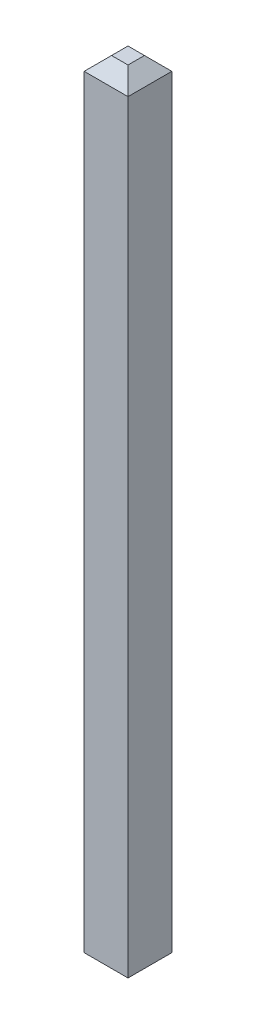
ISO-10303-21;
HEADER;
FILE_DESCRIPTION(('STEP AP214'),'2;1');
FILE_NAME('part.step','',(''),(''),'','','');
FILE_SCHEMA(('AUTOMOTIVE_DESIGN { 1 0 10303 214 1 1 1 1 }'));
ENDSEC;
DATA;
#1=APPLICATION_CONTEXT('core data for automotive mechanical design processes');
#2=APPLICATION_PROTOCOL_DEFINITION('international standard','automotive_design',2000,#1);
#3=PRODUCT_CONTEXT('',#1,'mechanical');
#4=PRODUCT('Part','Part','',(#3));
#5=PRODUCT_RELATED_PRODUCT_CATEGORY('part','',(#4));
#6=PRODUCT_DEFINITION_FORMATION('','',#4);
#7=PRODUCT_DEFINITION_CONTEXT('part definition',#1,'design');
#8=PRODUCT_DEFINITION('design','',#6,#7);
#9=PRODUCT_DEFINITION_SHAPE('','',#8);
#10=(LENGTH_UNIT() NAMED_UNIT(*) SI_UNIT(.MILLI.,.METRE.));
#11=(NAMED_UNIT(*) PLANE_ANGLE_UNIT() SI_UNIT($,.RADIAN.));
#12=(NAMED_UNIT(*) SI_UNIT($,.STERADIAN.) SOLID_ANGLE_UNIT());
#13=UNCERTAINTY_MEASURE_WITH_UNIT(LENGTH_MEASURE(1.E-05),#10,'distance_accuracy_value','');
#14=(GEOMETRIC_REPRESENTATION_CONTEXT(3) GLOBAL_UNCERTAINTY_ASSIGNED_CONTEXT((#13)) GLOBAL_UNIT_ASSIGNED_CONTEXT((#10,
#11,#12)) REPRESENTATION_CONTEXT('',''));
#15=CARTESIAN_POINT('',(0.,0.,0.));
#16=DIRECTION('',(0.,0.,1.));
#17=DIRECTION('',(1.,0.,0.));
#18=AXIS2_PLACEMENT_3D('',#15,#16,#17);
#19=CARTESIAN_POINT('',(3.93,-4.27,-0.32));
#20=DIRECTION('',(-0.707106781186548,0.707106781186548,0.));
#21=DIRECTION('',(-0.707106781186548,-0.707106781186548,0.));
#22=AXIS2_PLACEMENT_3D('',#19,#20,#21);
#23=PLANE('',#22);
#24=DIRECTION('',(0.,0.,1.));
#25=VECTOR('',#24,1.);
#26=CARTESIAN_POINT('',(4.13000000000001,-4.07,-0.32));
#27=LINE('',#26,#25);
#28=CARTESIAN_POINT('',(4.13,-4.07,-0.32));
#29=VERTEX_POINT('',#28);
#30=CARTESIAN_POINT('',(4.13,-4.07,0.32));
#31=VERTEX_POINT('',#30);
#32=EDGE_CURVE('E119',#29,#31,#27,.T.);
#33=ORIENTED_EDGE('',*,*,#32,.T.);
#34=DIRECTION('',(-0.577350269189626,-0.577350269189626,-0.577350269189626));
#35=VECTOR('',#34,1.);
#36=CARTESIAN_POINT('',(4.13,-4.07,0.32));
#37=LINE('',#36,#35);
#38=CARTESIAN_POINT('',(3.93,-4.27,0.12));
#39=VERTEX_POINT('',#38);
#40=EDGE_CURVE('E95',#31,#39,#37,.T.);
#41=ORIENTED_EDGE('',*,*,#40,.T.);
#42=DIRECTION('',(0.,0.,1.));
#43=VECTOR('',#42,1.);
#44=CARTESIAN_POINT('',(3.93,-4.27,-0.32));
#45=LINE('',#44,#43);
#46=CARTESIAN_POINT('',(3.93,-4.27,-0.12));
#47=VERTEX_POINT('',#46);
#48=EDGE_CURVE('E20',#39,#47,#45,.F.);
#49=ORIENTED_EDGE('',*,*,#48,.T.);
#50=DIRECTION('',(-0.577350269189626,-0.577350269189626,0.577350269189625));
#51=VECTOR('',#50,1.);
#52=CARTESIAN_POINT('',(4.13,-4.07,-0.32));
#53=LINE('',#52,#51);
#54=EDGE_CURVE('E84',#29,#47,#53,.T.);
#55=ORIENTED_EDGE('',*,*,#54,.F.);
#56=EDGE_LOOP('',(#33,#41,#49,#55));
#57=FACE_BOUND('',#56,.T.);
#58=ADVANCED_FACE('F17',(#57),#23,.F.);
#59=CARTESIAN_POINT('',(4.13,7.07,-0.32));
#60=DIRECTION('',(-0.707106781186548,-0.707106781186548,0.));
#61=DIRECTION('',(0.707106781186548,-0.707106781186548,0.));
#62=AXIS2_PLACEMENT_3D('',#59,#60,#61);
#63=PLANE('',#62);
#64=DIRECTION('',(0.,0.,1.));
#65=VECTOR('',#64,1.);
#66=CARTESIAN_POINT('',(4.13,7.07,-0.32));
#67=LINE('',#66,#65);
#68=CARTESIAN_POINT('',(4.13,7.07,0.32));
#69=VERTEX_POINT('',#68);
#70=CARTESIAN_POINT('',(4.13,7.07,-0.319999999999999));
#71=VERTEX_POINT('',#70);
#72=EDGE_CURVE('E121',#69,#71,#67,.F.);
#73=ORIENTED_EDGE('',*,*,#72,.T.);
#74=DIRECTION('',(0.577350269189627,-0.577350269189627,-0.577350269189624));
#75=VECTOR('',#74,1.);
#76=CARTESIAN_POINT('',(3.93,7.27,-0.12));
#77=LINE('',#76,#75);
#78=CARTESIAN_POINT('',(3.93,7.27,-0.12));
#79=VERTEX_POINT('',#78);
#80=EDGE_CURVE('E78',#79,#71,#77,.T.);
#81=ORIENTED_EDGE('',*,*,#80,.F.);
#82=DIRECTION('',(0.,0.,1.));
#83=VECTOR('',#82,1.);
#84=CARTESIAN_POINT('',(3.93,7.27,-0.32));
#85=LINE('',#84,#83);
#86=CARTESIAN_POINT('',(3.93,7.27,0.12));
#87=VERTEX_POINT('',#86);
#88=EDGE_CURVE('E108',#79,#87,#85,.T.);
#89=ORIENTED_EDGE('',*,*,#88,.T.);
#90=DIRECTION('',(0.577350269189627,-0.577350269189627,0.577350269189624));
#91=VECTOR('',#90,1.);
#92=CARTESIAN_POINT('',(3.93,7.27,0.119999999999999));
#93=LINE('',#92,#91);
#94=EDGE_CURVE('E116',#87,#69,#93,.T.);
#95=ORIENTED_EDGE('',*,*,#94,.T.);
#96=EDGE_LOOP('',(#73,#81,#89,#95));
#97=FACE_BOUND('',#96,.T.);
#98=ADVANCED_FACE('F214',(#97),#63,.F.);
#99=CARTESIAN_POINT('',(4.13,-4.27,-0.32));
#100=DIRECTION('',(0.,1.,0.));
#101=DIRECTION('',(0.,0.,1.));
#102=AXIS2_PLACEMENT_3D('',#99,#100,#101);
#103=PLANE('',#102);
#104=DIRECTION('',(1.,0.,0.));
#105=VECTOR('',#104,1.);
#106=CARTESIAN_POINT('',(4.13,-4.27,0.12));
#107=LINE('',#106,#105);
#108=CARTESIAN_POINT('',(3.69,-4.27,0.12));
#109=VERTEX_POINT('',#108);
#110=EDGE_CURVE('E110',#39,#109,#107,.F.);
#111=ORIENTED_EDGE('',*,*,#110,.T.);
#112=DIRECTION('',(0.,0.,1.));
#113=VECTOR('',#112,1.);
#114=CARTESIAN_POINT('',(3.69,-4.27,-0.32));
#115=LINE('',#114,#113);
#116=CARTESIAN_POINT('',(3.69,-4.27,-0.12));
#117=VERTEX_POINT('',#116);
#118=EDGE_CURVE('E101',#109,#117,#115,.F.);
#119=ORIENTED_EDGE('',*,*,#118,.T.);
#120=DIRECTION('',(1.,0.,0.));
#121=VECTOR('',#120,1.);
#122=CARTESIAN_POINT('',(3.81,-4.27,-0.12));
#123=LINE('',#122,#121);
#124=EDGE_CURVE('E89',#47,#117,#123,.F.);
#125=ORIENTED_EDGE('',*,*,#124,.F.);
#126=ORIENTED_EDGE('',*,*,#48,.F.);
#127=EDGE_LOOP('',(#111,#119,#125,#126));
#128=FACE_BOUND('',#127,.T.);
#129=ADVANCED_FACE('F99',(#128),#103,.F.);
#130=CARTESIAN_POINT('',(3.81,-4.07,-0.32));
#131=DIRECTION('',(0.,-0.707106781186548,-0.707106781186548));
#132=DIRECTION('',(0.,0.707106781186548,-0.707106781186548));
#133=AXIS2_PLACEMENT_3D('',#130,#131,#132);
#134=PLANE('',#133);
#135=ORIENTED_EDGE('',*,*,#54,.T.);
#136=ORIENTED_EDGE('',*,*,#124,.T.);
#137=DIRECTION('',(-0.577350269189624,0.577350269189626,-0.577350269189627));
#138=VECTOR('',#137,1.);
#139=CARTESIAN_POINT('',(3.69,-4.27,-0.12));
#140=LINE('',#139,#138);
#141=CARTESIAN_POINT('',(3.49,-4.07,-0.32));
#142=VERTEX_POINT('',#141);
#143=EDGE_CURVE('E127',#117,#142,#140,.T.);
#144=ORIENTED_EDGE('',*,*,#143,.T.);
#145=DIRECTION('',(-1.,0.,0.));
#146=VECTOR('',#145,1.);
#147=CARTESIAN_POINT('',(3.81,-4.07,-0.320000000000001));
#148=LINE('',#147,#146);
#149=EDGE_CURVE('E91',#29,#142,#148,.T.);
#150=ORIENTED_EDGE('',*,*,#149,.F.);
#151=EDGE_LOOP('',(#135,#136,#144,#150));
#152=FACE_BOUND('',#151,.T.);
#153=ADVANCED_FACE('F86',(#152),#134,.T.);
#154=CARTESIAN_POINT('',(3.81,7.07,-0.32));
#155=DIRECTION('',(0.,0.707106781186548,-0.707106781186548));
#156=DIRECTION('',(0.,0.707106781186548,0.707106781186548));
#157=AXIS2_PLACEMENT_3D('',#154,#155,#156);
#158=PLANE('',#157);
#159=ORIENTED_EDGE('',*,*,#80,.T.);
#160=DIRECTION('',(-1.,0.,0.));
#161=VECTOR('',#160,1.);
#162=CARTESIAN_POINT('',(3.81,7.07,-0.319999999999999));
#163=LINE('',#162,#161);
#164=CARTESIAN_POINT('',(3.49,7.07,-0.32));
#165=VERTEX_POINT('',#164);
#166=EDGE_CURVE('E129',#165,#71,#163,.F.);
#167=ORIENTED_EDGE('',*,*,#166,.F.);
#168=DIRECTION('',(0.577350269189625,0.577350269189624,0.577350269189628));
#169=VECTOR('',#168,1.);
#170=CARTESIAN_POINT('',(3.49,7.07,-0.32));
#171=LINE('',#170,#169);
#172=CARTESIAN_POINT('',(3.69,7.27,-0.120000000000001));
#173=VERTEX_POINT('',#172);
#174=EDGE_CURVE('E136',#165,#173,#171,.T.);
#175=ORIENTED_EDGE('',*,*,#174,.T.);
#176=DIRECTION('',(1.,0.,0.));
#177=VECTOR('',#176,1.);
#178=CARTESIAN_POINT('',(3.49,7.27,-0.12));
#179=LINE('',#178,#177);
#180=EDGE_CURVE('E103',#173,#79,#179,.T.);
#181=ORIENTED_EDGE('',*,*,#180,.T.);
#182=EDGE_LOOP('',(#159,#167,#175,#181));
#183=FACE_BOUND('',#182,.T.);
#184=ADVANCED_FACE('F206',(#183),#158,.T.);
#185=CARTESIAN_POINT('',(3.49,7.27,-0.32));
#186=DIRECTION('',(0.,-1.,0.));
#187=DIRECTION('',(1.,0.,0.));
#188=AXIS2_PLACEMENT_3D('',#185,#186,#187);
#189=PLANE('',#188);
#190=ORIENTED_EDGE('',*,*,#180,.F.);
#191=DIRECTION('',(0.,0.,1.));
#192=VECTOR('',#191,1.);
#193=CARTESIAN_POINT('',(3.69,7.27,-0.32));
#194=LINE('',#193,#192);
#195=CARTESIAN_POINT('',(3.69,7.27,0.12));
#196=VERTEX_POINT('',#195);
#197=EDGE_CURVE('E139',#173,#196,#194,.T.);
#198=ORIENTED_EDGE('',*,*,#197,.T.);
#199=DIRECTION('',(1.,0.,0.));
#200=VECTOR('',#199,1.);
#201=CARTESIAN_POINT('',(3.49,7.27,0.12));
#202=LINE('',#201,#200);
#203=EDGE_CURVE('E113',#196,#87,#202,.T.);
#204=ORIENTED_EDGE('',*,*,#203,.T.);
#205=ORIENTED_EDGE('',*,*,#88,.F.);
#206=EDGE_LOOP('',(#190,#198,#204,#205));
#207=FACE_BOUND('',#206,.T.);
#208=ADVANCED_FACE('F203',(#207),#189,.F.);
#209=CARTESIAN_POINT('',(4.13,-4.27,0.12));
#210=DIRECTION('',(0.,0.707106781186548,-0.707106781186548));
#211=DIRECTION('',(0.,0.707106781186548,0.707106781186548));
#212=AXIS2_PLACEMENT_3D('',#209,#210,#211);
#213=PLANE('',#212);
#214=DIRECTION('',(-1.,0.,0.));
#215=VECTOR('',#214,1.);
#216=CARTESIAN_POINT('',(3.81,-4.07,0.319999999999999));
#217=LINE('',#216,#215);
#218=CARTESIAN_POINT('',(3.49,-4.07,0.32));
#219=VERTEX_POINT('',#218);
#220=EDGE_CURVE('E144',#31,#219,#217,.T.);
#221=ORIENTED_EDGE('',*,*,#220,.T.);
#222=DIRECTION('',(0.577350269189625,-0.577350269189626,-0.577350269189627));
#223=VECTOR('',#222,1.);
#224=CARTESIAN_POINT('',(3.49,-4.07,0.32));
#225=LINE('',#224,#223);
#226=EDGE_CURVE('E123',#219,#109,#225,.T.);
#227=ORIENTED_EDGE('',*,*,#226,.T.);
#228=ORIENTED_EDGE('',*,*,#110,.F.);
#229=ORIENTED_EDGE('',*,*,#40,.F.);
#230=EDGE_LOOP('',(#221,#227,#228,#229));
#231=FACE_BOUND('',#230,.T.);
#232=ADVANCED_FACE('F176',(#231),#213,.F.);
#233=CARTESIAN_POINT('',(3.49,7.27,0.12));
#234=DIRECTION('',(0.,-0.707106781186548,-0.707106781186548));
#235=DIRECTION('',(0.,0.707106781186548,-0.707106781186548));
#236=AXIS2_PLACEMENT_3D('',#233,#234,#235);
#237=PLANE('',#236);
#238=ORIENTED_EDGE('',*,*,#203,.F.);
#239=DIRECTION('',(-0.577350269189625,-0.577350269189624,0.577350269189628));
#240=VECTOR('',#239,1.);
#241=CARTESIAN_POINT('',(3.69,7.27,0.12));
#242=LINE('',#241,#240);
#243=CARTESIAN_POINT('',(3.49,7.07,0.32));
#244=VERTEX_POINT('',#243);
#245=EDGE_CURVE('E142',#196,#244,#242,.T.);
#246=ORIENTED_EDGE('',*,*,#245,.T.);
#247=DIRECTION('',(-1.,0.,0.));
#248=VECTOR('',#247,1.);
#249=CARTESIAN_POINT('',(3.81,7.07,0.320000000000001));
#250=LINE('',#249,#248);
#251=EDGE_CURVE('E34',#244,#69,#250,.F.);
#252=ORIENTED_EDGE('',*,*,#251,.T.);
#253=ORIENTED_EDGE('',*,*,#94,.F.);
#254=EDGE_LOOP('',(#238,#246,#252,#253));
#255=FACE_BOUND('',#254,.T.);
#256=ADVANCED_FACE('F196',(#255),#237,.F.);
#257=CARTESIAN_POINT('',(4.13,7.27,-0.32));
#258=DIRECTION('',(-1.,0.,0.));
#259=DIRECTION('',(0.,-1.,0.));
#260=AXIS2_PLACEMENT_3D('',#257,#258,#259);
#261=PLANE('',#260);
#262=ORIENTED_EDGE('',*,*,#72,.F.);
#263=DIRECTION('',(0.,1.,0.));
#264=VECTOR('',#263,1.);
#265=CARTESIAN_POINT('',(4.13,1.5,0.32));
#266=LINE('',#265,#264);
#267=EDGE_CURVE('E148',#69,#31,#266,.F.);
#268=ORIENTED_EDGE('',*,*,#267,.T.);
#269=ORIENTED_EDGE('',*,*,#32,.F.);
#270=DIRECTION('',(0.,1.,0.));
#271=VECTOR('',#270,1.);
#272=CARTESIAN_POINT('',(4.13,1.5,-0.32));
#273=LINE('',#272,#271);
#274=EDGE_CURVE('E132',#71,#29,#273,.F.);
#275=ORIENTED_EDGE('',*,*,#274,.F.);
#276=EDGE_LOOP('',(#262,#268,#269,#275));
#277=FACE_BOUND('',#276,.T.);
#278=ADVANCED_FACE('F193',(#277),#261,.F.);
#279=CARTESIAN_POINT('',(3.49,-4.07,-0.32));
#280=DIRECTION('',(0.707106781186548,0.707106781186548,0.));
#281=DIRECTION('',(-0.707106781186548,0.707106781186548,0.));
#282=AXIS2_PLACEMENT_3D('',#279,#280,#281);
#283=PLANE('',#282);
#284=ORIENTED_EDGE('',*,*,#118,.F.);
#285=ORIENTED_EDGE('',*,*,#226,.F.);
#286=DIRECTION('',(0.,0.,-1.));
#287=VECTOR('',#286,1.);
#288=CARTESIAN_POINT('',(3.49,-4.07,-0.32));
#289=LINE('',#288,#287);
#290=EDGE_CURVE('E151',#219,#142,#289,.T.);
#291=ORIENTED_EDGE('',*,*,#290,.T.);
#292=ORIENTED_EDGE('',*,*,#143,.F.);
#293=EDGE_LOOP('',(#284,#285,#291,#292));
#294=FACE_BOUND('',#293,.T.);
#295=ADVANCED_FACE('F173',(#294),#283,.F.);
#296=CARTESIAN_POINT('',(3.81,1.5,-0.32));
#297=DIRECTION('',(0.,0.,-1.));
#298=DIRECTION('',(-1.,0.,0.));
#299=AXIS2_PLACEMENT_3D('',#296,#297,#298);
#300=PLANE('',#299);
#301=ORIENTED_EDGE('',*,*,#274,.T.);
#302=ORIENTED_EDGE('',*,*,#149,.T.);
#303=DIRECTION('',(0.,1.,0.));
#304=VECTOR('',#303,1.);
#305=CARTESIAN_POINT('',(3.49,-4.27,-0.32));
#306=LINE('',#305,#304);
#307=EDGE_CURVE('E154',#142,#165,#306,.T.);
#308=ORIENTED_EDGE('',*,*,#307,.T.);
#309=ORIENTED_EDGE('',*,*,#166,.T.);
#310=EDGE_LOOP('',(#301,#302,#308,#309));
#311=FACE_BOUND('',#310,.T.);
#312=ADVANCED_FACE('F170',(#311),#300,.T.);
#313=CARTESIAN_POINT('',(3.69,7.27,-0.32));
#314=DIRECTION('',(0.707106781186548,-0.707106781186548,0.));
#315=DIRECTION('',(0.707106781186548,0.707106781186548,0.));
#316=AXIS2_PLACEMENT_3D('',#313,#314,#315);
#317=PLANE('',#316);
#318=ORIENTED_EDGE('',*,*,#197,.F.);
#319=ORIENTED_EDGE('',*,*,#174,.F.);
#320=DIRECTION('',(0.,0.,-1.));
#321=VECTOR('',#320,1.);
#322=CARTESIAN_POINT('',(3.49,7.07,-0.32));
#323=LINE('',#322,#321);
#324=EDGE_CURVE('E26',#165,#244,#323,.F.);
#325=ORIENTED_EDGE('',*,*,#324,.T.);
#326=ORIENTED_EDGE('',*,*,#245,.F.);
#327=EDGE_LOOP('',(#318,#319,#325,#326));
#328=FACE_BOUND('',#327,.T.);
#329=ADVANCED_FACE('F162',(#328),#317,.F.);
#330=CARTESIAN_POINT('',(3.81,1.5,0.32));
#331=DIRECTION('',(0.,0.,-1.));
#332=DIRECTION('',(-1.,0.,0.));
#333=AXIS2_PLACEMENT_3D('',#330,#331,#332);
#334=PLANE('',#333);
#335=ORIENTED_EDGE('',*,*,#251,.F.);
#336=DIRECTION('',(0.,1.,0.));
#337=VECTOR('',#336,1.);
#338=CARTESIAN_POINT('',(3.49,-4.27,0.32));
#339=LINE('',#338,#337);
#340=EDGE_CURVE('E11',#244,#219,#339,.F.);
#341=ORIENTED_EDGE('',*,*,#340,.T.);
#342=ORIENTED_EDGE('',*,*,#220,.F.);
#343=ORIENTED_EDGE('',*,*,#267,.F.);
#344=EDGE_LOOP('',(#335,#341,#342,#343));
#345=FACE_BOUND('',#344,.T.);
#346=ADVANCED_FACE('F177',(#345),#334,.F.);
#347=CARTESIAN_POINT('',(3.49,-4.27,-0.32));
#348=DIRECTION('',(1.,0.,0.));
#349=DIRECTION('',(0.,0.,-1.));
#350=AXIS2_PLACEMENT_3D('',#347,#348,#349);
#351=PLANE('',#350);
#352=ORIENTED_EDGE('',*,*,#324,.F.);
#353=ORIENTED_EDGE('',*,*,#307,.F.);
#354=ORIENTED_EDGE('',*,*,#290,.F.);
#355=ORIENTED_EDGE('',*,*,#340,.F.);
#356=EDGE_LOOP('',(#352,#353,#354,#355));
#357=FACE_BOUND('',#356,.T.);
#358=ADVANCED_FACE('F167',(#357),#351,.F.);
#359=CLOSED_SHELL('',(#58,#98,#129,#153,#184,#208,#232,#256,#278,#295,#312,#329,#346,#358));
#360=MANIFOLD_SOLID_BREP('B1',#359);
#361=ADVANCED_BREP_SHAPE_REPRESENTATION('',(#18,#360),#14);
#362=SHAPE_DEFINITION_REPRESENTATION(#9,#361);
ENDSEC;
END-ISO-10303-21;
